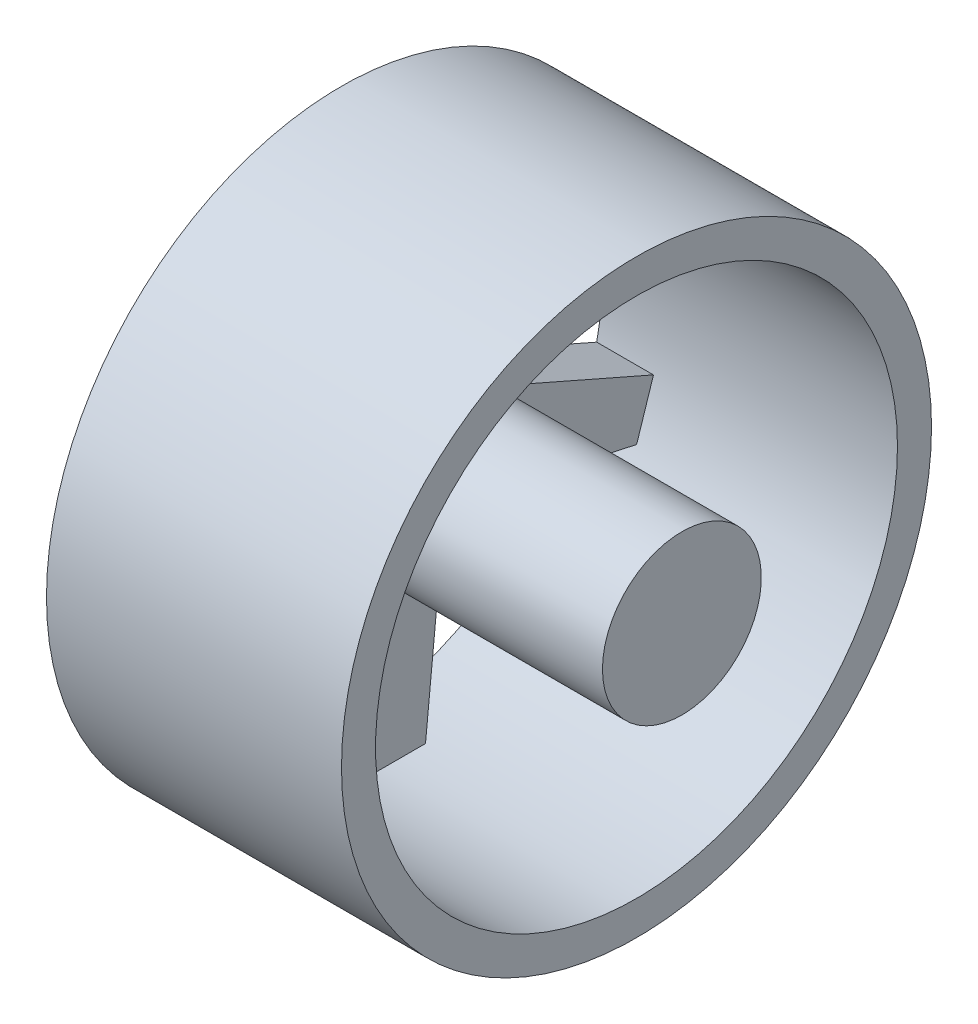
ISO-10303-21;
HEADER;
FILE_DESCRIPTION(('STEP AP214'),'2;1');
FILE_NAME('part.step','',(''),(''),'','','');
FILE_SCHEMA(('AUTOMOTIVE_DESIGN { 1 0 10303 214 1 1 1 1 }'));
ENDSEC;
DATA;
#1=APPLICATION_CONTEXT('core data for automotive mechanical design processes');
#2=APPLICATION_PROTOCOL_DEFINITION('international standard','automotive_design',2000,#1);
#3=PRODUCT_CONTEXT('',#1,'mechanical');
#4=PRODUCT('Part','Part','',(#3));
#5=PRODUCT_RELATED_PRODUCT_CATEGORY('part','',(#4));
#6=PRODUCT_DEFINITION_FORMATION('','',#4);
#7=PRODUCT_DEFINITION_CONTEXT('part definition',#1,'design');
#8=PRODUCT_DEFINITION('design','',#6,#7);
#9=PRODUCT_DEFINITION_SHAPE('','',#8);
#10=(LENGTH_UNIT() NAMED_UNIT(*) SI_UNIT(.MILLI.,.METRE.));
#11=(NAMED_UNIT(*) PLANE_ANGLE_UNIT() SI_UNIT($,.RADIAN.));
#12=(NAMED_UNIT(*) SI_UNIT($,.STERADIAN.) SOLID_ANGLE_UNIT());
#13=UNCERTAINTY_MEASURE_WITH_UNIT(LENGTH_MEASURE(1.E-05),#10,'distance_accuracy_value','');
#14=(GEOMETRIC_REPRESENTATION_CONTEXT(3) GLOBAL_UNCERTAINTY_ASSIGNED_CONTEXT((#13)) GLOBAL_UNIT_ASSIGNED_CONTEXT((#10,
#11,#12)) REPRESENTATION_CONTEXT('',''));
#15=CARTESIAN_POINT('',(0.,0.,0.));
#16=DIRECTION('',(0.,0.,1.));
#17=DIRECTION('',(1.,0.,0.));
#18=AXIS2_PLACEMENT_3D('',#15,#16,#17);
#19=CARTESIAN_POINT('',(30.,0.,0.));
#20=DIRECTION('',(-1.,0.,0.));
#21=DIRECTION('',(0.,0.,1.));
#22=AXIS2_PLACEMENT_3D('',#19,#20,#21);
#23=CYLINDRICAL_SURFACE('',#22,7.);
#24=CARTESIAN_POINT('',(30.,0.,0.));
#25=DIRECTION('',(-1.,0.,0.));
#26=DIRECTION('',(0.,0.,1.));
#27=AXIS2_PLACEMENT_3D('',#24,#25,#26);
#28=CIRCLE('',#27,7.);
#29=CARTESIAN_POINT('',(30.,0.,7.));
#30=VERTEX_POINT('',#29);
#31=EDGE_CURVE('E13',#30,#30,#28,.T.);
#32=ORIENTED_EDGE('',*,*,#31,.T.);
#33=EDGE_LOOP('',(#32));
#34=FACE_BOUND('',#33,.T.);
#35=CARTESIAN_POINT('',(5.,0.,0.));
#36=DIRECTION('',(-1.,0.,0.));
#37=DIRECTION('',(0.,0.,1.));
#38=AXIS2_PLACEMENT_3D('',#35,#36,#37);
#39=CIRCLE('',#38,7.);
#40=CARTESIAN_POINT('',(5.,-5.66311896062463,-4.11449676604731));
#41=VERTEX_POINT('',#40);
#42=CARTESIAN_POINT('',(5.,-5.66311896062463,4.11449676604731));
#43=VERTEX_POINT('',#42);
#44=EDGE_CURVE('E89',#41,#43,#39,.T.);
#45=ORIENTED_EDGE('',*,*,#44,.F.);
#46=CARTESIAN_POINT('',(5.,0.,0.));
#47=DIRECTION('',(-1.,0.,0.));
#48=DIRECTION('',(0.,0.,1.));
#49=AXIS2_PLACEMENT_3D('',#46,#47,#48);
#50=CIRCLE('',#49,7.);
#51=CARTESIAN_POINT('',(5.,2.16311896062463,-6.65739561406607));
#52=VERTEX_POINT('',#51);
#53=EDGE_CURVE('E213',#52,#41,#50,.T.);
#54=ORIENTED_EDGE('',*,*,#53,.F.);
#55=CARTESIAN_POINT('',(5.,0.,0.));
#56=DIRECTION('',(-1.,0.,0.));
#57=DIRECTION('',(0.,0.,1.));
#58=AXIS2_PLACEMENT_3D('',#55,#56,#57);
#59=CIRCLE('',#58,7.);
#60=CARTESIAN_POINT('',(5.,7.,0.));
#61=VERTEX_POINT('',#60);
#62=EDGE_CURVE('E293',#61,#52,#59,.T.);
#63=ORIENTED_EDGE('',*,*,#62,.F.);
#64=CARTESIAN_POINT('',(5.,0.,0.));
#65=DIRECTION('',(-1.,0.,0.));
#66=DIRECTION('',(0.,0.,1.));
#67=AXIS2_PLACEMENT_3D('',#64,#65,#66);
#68=CIRCLE('',#67,7.);
#69=CARTESIAN_POINT('',(5.,2.16311896062463,6.65739561406608));
#70=VERTEX_POINT('',#69);
#71=EDGE_CURVE('E271',#70,#61,#68,.T.);
#72=ORIENTED_EDGE('',*,*,#71,.F.);
#73=CARTESIAN_POINT('',(5.,0.,0.));
#74=DIRECTION('',(-1.,0.,0.));
#75=DIRECTION('',(0.,0.,1.));
#76=AXIS2_PLACEMENT_3D('',#73,#74,#75);
#77=CIRCLE('',#76,7.);
#78=EDGE_CURVE('E94',#43,#70,#77,.T.);
#79=ORIENTED_EDGE('',*,*,#78,.F.);
#80=EDGE_LOOP('',(#45,#54,#63,#72,#79));
#81=FACE_BOUND('',#80,.T.);
#82=ADVANCED_FACE('F75',(#34,#81),#23,.T.);
#83=CARTESIAN_POINT('',(30.,0.,0.));
#84=DIRECTION('',(-1.,0.,0.));
#85=DIRECTION('',(0.,0.,1.));
#86=AXIS2_PLACEMENT_3D('',#83,#84,#85);
#87=PLANE('',#86);
#88=ORIENTED_EDGE('',*,*,#31,.F.);
#89=EDGE_LOOP('',(#88));
#90=FACE_BOUND('',#89,.T.);
#91=ADVANCED_FACE('F390',(#90),#87,.F.);
#92=CARTESIAN_POINT('',(0.,0.,0.));
#93=DIRECTION('',(-1.,0.,0.));
#94=DIRECTION('',(0.,0.,1.));
#95=AXIS2_PLACEMENT_3D('',#92,#93,#94);
#96=PLANE('',#95);
#97=CARTESIAN_POINT('',(0.,0.,0.));
#98=DIRECTION('',(-1.,0.,0.));
#99=DIRECTION('',(0.,0.,1.));
#100=AXIS2_PLACEMENT_3D('',#97,#98,#99);
#101=CIRCLE('',#100,6.5);
#102=CARTESIAN_POINT('',(0.,0.,6.5));
#103=VERTEX_POINT('',#102);
#104=EDGE_CURVE('E458',#103,#103,#101,.T.);
#105=ORIENTED_EDGE('',*,*,#104,.F.);
#106=EDGE_LOOP('',(#105));
#107=FACE_BOUND('',#106,.T.);
#108=DIRECTION('',(0.,0.863176825578891,-0.504901740721448));
#109=VECTOR('',#108,1.);
#110=CARTESIAN_POINT('',(0.,-2.34998794471693,-4.01752454125229));
#111=LINE('',#110,#109);
#112=CARTESIAN_POINT('',(0.,2.16311896062463,-6.65739561406607));
#113=VERTEX_POINT('',#112);
#114=CARTESIAN_POINT('',(0.,17.0923309859801,-15.3900039462538));
#115=VERTEX_POINT('',#114);
#116=EDGE_CURVE('E297',#113,#115,#111,.T.);
#117=ORIENTED_EDGE('',*,*,#116,.F.);
#118=DIRECTION('',(0.,-0.401550923991079,-0.915836696929049));
#119=VECTOR('',#118,1.);
#120=CARTESIAN_POINT('',(0.,4.26262185992344,-1.86895737222182));
#121=LINE('',#120,#119);
#122=CARTESIAN_POINT('',(0.,-4.78196888880848,-22.4973948168776));
#123=VERTEX_POINT('',#122);
#124=EDGE_CURVE('E211',#113,#123,#121,.T.);
#125=ORIENTED_EDGE('',*,*,#124,.T.);
#126=DIRECTION('',(0.,-0.951056516295154,0.309016994374947));
#127=VECTOR('',#126,1.);
#128=CARTESIAN_POINT('',(0.,-7.06845583977594,-21.7544701713287));
#129=LINE('',#128,#127);
#130=CARTESIAN_POINT('',(0.,-9.3549427907434,-21.0115455257798));
#131=VERTEX_POINT('',#130);
#132=EDGE_CURVE('E186',#123,#131,#129,.T.);
#133=ORIENTED_EDGE('',*,*,#132,.T.);
#134=DIRECTION('',(0.,-0.213453782347401,-0.976953163054191));
#135=VECTOR('',#134,1.);
#136=CARTESIAN_POINT('',(0.,-4.54707910582749,0.993487989472711));
#137=LINE('',#136,#135);
#138=CARTESIAN_POINT('',(0.,-5.66311896062464,-4.11449676604731));
#139=VERTEX_POINT('',#138);
#140=EDGE_CURVE('E203',#139,#131,#137,.T.);
#141=ORIENTED_EDGE('',*,*,#140,.F.);
#142=DIRECTION('',(0.,-0.995098518096808,0.0988885194627609));
#143=VECTOR('',#142,1.);
#144=CARTESIAN_POINT('',(0.,-0.460261492218939,-4.63153388616124));
#145=LINE('',#144,#143);
#146=CARTESIAN_POINT('',(0.,-22.8740035934703,-2.40415465515602));
#147=VERTEX_POINT('',#146);
#148=EDGE_CURVE('E230',#139,#147,#145,.T.);
#149=ORIENTED_EDGE('',*,*,#148,.T.);
#150=DIRECTION('',(0.,0.,1.));
#151=VECTOR('',#150,1.);
#152=CARTESIAN_POINT('',(0.,-22.8740035934703,0.));
#153=LINE('',#152,#151);
#154=CARTESIAN_POINT('',(0.,-22.8740035934703,2.40415465515604));
#155=VERTEX_POINT('',#154);
#156=EDGE_CURVE('E226',#147,#155,#153,.T.);
#157=ORIENTED_EDGE('',*,*,#156,.T.);
#158=DIRECTION('',(0.,-0.995098518096808,-0.0988885194627599));
#159=VECTOR('',#158,1.);
#160=CARTESIAN_POINT('',(0.,-0.460261492218934,4.63153388616123));
#161=LINE('',#160,#159);
#162=CARTESIAN_POINT('',(0.,-5.66311896062463,4.11449676604732));
#163=VERTEX_POINT('',#162);
#164=EDGE_CURVE('E214',#163,#155,#161,.T.);
#165=ORIENTED_EDGE('',*,*,#164,.F.);
#166=DIRECTION('',(0.,-0.213453782347402,0.976953163054191));
#167=VECTOR('',#166,1.);
#168=CARTESIAN_POINT('',(0.,-4.54707910582748,-0.993487989472714));
#169=LINE('',#168,#167);
#170=CARTESIAN_POINT('',(0.,-9.35494279074341,21.0115455257798));
#171=VERTEX_POINT('',#170);
#172=EDGE_CURVE('E256',#163,#171,#169,.T.);
#173=ORIENTED_EDGE('',*,*,#172,.T.);
#174=DIRECTION('',(0.,0.951056516295154,0.309016994374948));
#175=VECTOR('',#174,1.);
#176=CARTESIAN_POINT('',(0.,-7.06845583977594,21.7544701713287));
#177=LINE('',#176,#175);
#178=CARTESIAN_POINT('',(0.,-4.78196888880846,22.4973948168776));
#179=VERTEX_POINT('',#178);
#180=EDGE_CURVE('E252',#171,#179,#177,.T.);
#181=ORIENTED_EDGE('',*,*,#180,.T.);
#182=DIRECTION('',(0.,-0.401550923991078,0.91583669692905));
#183=VECTOR('',#182,1.);
#184=CARTESIAN_POINT('',(0.,4.26262185992343,1.86895737222181));
#185=LINE('',#184,#183);
#186=CARTESIAN_POINT('',(0.,2.16311896062463,6.65739561406608));
#187=VERTEX_POINT('',#186);
#188=EDGE_CURVE('E243',#187,#179,#185,.T.);
#189=ORIENTED_EDGE('',*,*,#188,.F.);
#190=DIRECTION('',(0.,0.863176825578891,0.504901740721448));
#191=VECTOR('',#190,1.);
#192=CARTESIAN_POINT('',(0.,-2.34998794471693,4.01752454125229));
#193=LINE('',#192,#191);
#194=CARTESIAN_POINT('',(0.,17.0923309859801,15.3900039462538));
#195=VERTEX_POINT('',#194);
#196=EDGE_CURVE('E282',#187,#195,#193,.T.);
#197=ORIENTED_EDGE('',*,*,#196,.T.);
#198=DIRECTION('',(0.,0.587785252292474,-0.809016994374947));
#199=VECTOR('',#198,1.);
#200=CARTESIAN_POINT('',(0.,18.5054576365111,13.4450019731269));
#201=LINE('',#200,#199);
#202=CARTESIAN_POINT('',(0.,19.9185842870421,11.5));
#203=VERTEX_POINT('',#202);
#204=EDGE_CURVE('E278',#195,#203,#201,.T.);
#205=ORIENTED_EDGE('',*,*,#204,.T.);
#206=DIRECTION('',(0.,0.746926398856396,0.66490672630935));
#207=VECTOR('',#206,1.);
#208=CARTESIAN_POINT('',(0.,3.09470668283991,-3.47645470660346));
#209=LINE('',#208,#207);
#210=CARTESIAN_POINT('',(0.,7.,0.));
#211=VERTEX_POINT('',#210);
#212=EDGE_CURVE('E268',#211,#203,#209,.T.);
#213=ORIENTED_EDGE('',*,*,#212,.F.);
#214=DIRECTION('',(0.,0.746926398856396,-0.664906726309349));
#215=VECTOR('',#214,1.);
#216=CARTESIAN_POINT('',(0.,3.09470668283991,3.47645470660346));
#217=LINE('',#216,#215);
#218=CARTESIAN_POINT('',(0.,19.9185842870421,-11.5));
#219=VERTEX_POINT('',#218);
#220=EDGE_CURVE('E281',#211,#219,#217,.T.);
#221=ORIENTED_EDGE('',*,*,#220,.T.);
#222=DIRECTION('',(0.,-0.587785252292473,-0.809016994374947));
#223=VECTOR('',#222,1.);
#224=CARTESIAN_POINT('',(0.,18.5054576365111,-13.4450019731269));
#225=LINE('',#224,#223);
#226=EDGE_CURVE('E308',#219,#115,#225,.T.);
#227=ORIENTED_EDGE('',*,*,#226,.T.);
#228=EDGE_LOOP('',(#117,#125,#133,#141,#149,#157,#165,#173,#181,#189,#197,#205,#213,#221,#227));
#229=FACE_BOUND('',#228,.T.);
#230=ADVANCED_FACE('F340',(#107,#229),#96,.T.);
#231=CARTESIAN_POINT('',(5.,-2.34998794471693,-4.01752454125229));
#232=DIRECTION('',(0.,0.504901740721448,0.863176825578891));
#233=DIRECTION('',(0.,-0.863176825578891,0.504901740721448));
#234=AXIS2_PLACEMENT_3D('',#231,#232,#233);
#235=PLANE('',#234);
#236=ORIENTED_EDGE('',*,*,#116,.T.);
#237=DIRECTION('',(-1.,0.,0.));
#238=VECTOR('',#237,1.);
#239=CARTESIAN_POINT('',(5.,17.0923309859801,-15.3900039462538));
#240=LINE('',#239,#238);
#241=CARTESIAN_POINT('',(5.,17.0923309859801,-15.3900039462538));
#242=VERTEX_POINT('',#241);
#243=EDGE_CURVE('E314',#242,#115,#240,.T.);
#244=ORIENTED_EDGE('',*,*,#243,.F.);
#245=DIRECTION('',(0.,0.863176825578891,-0.504901740721448));
#246=VECTOR('',#245,1.);
#247=CARTESIAN_POINT('',(5.,-2.34998794471693,-4.01752454125229));
#248=LINE('',#247,#246);
#249=EDGE_CURVE('E303',#52,#242,#248,.T.);
#250=ORIENTED_EDGE('',*,*,#249,.F.);
#251=DIRECTION('',(-1.,0.,0.));
#252=VECTOR('',#251,1.);
#253=CARTESIAN_POINT('',(5.,2.16311896062463,-6.65739561406607));
#254=LINE('',#253,#252);
#255=EDGE_CURVE('E82',#52,#113,#254,.T.);
#256=ORIENTED_EDGE('',*,*,#255,.T.);
#257=EDGE_LOOP('',(#236,#244,#250,#256));
#258=FACE_BOUND('',#257,.T.);
#259=ADVANCED_FACE('F334',(#258),#235,.F.);
#260=CARTESIAN_POINT('',(5.,18.5054576365111,-13.4450019731269));
#261=DIRECTION('',(0.,0.809016994374947,-0.587785252292473));
#262=DIRECTION('',(0.,0.587785252292473,0.809016994374948));
#263=AXIS2_PLACEMENT_3D('',#260,#261,#262);
#264=PLANE('',#263);
#265=ORIENTED_EDGE('',*,*,#226,.F.);
#266=DIRECTION('',(-1.,0.,0.));
#267=VECTOR('',#266,1.);
#268=CARTESIAN_POINT('',(5.,19.9185842870421,-11.5));
#269=LINE('',#268,#267);
#270=CARTESIAN_POINT('',(5.,19.9185842870421,-11.5));
#271=VERTEX_POINT('',#270);
#272=EDGE_CURVE('E316',#271,#219,#269,.T.);
#273=ORIENTED_EDGE('',*,*,#272,.F.);
#274=DIRECTION('',(0.,-0.587785252292473,-0.809016994374947));
#275=VECTOR('',#274,1.);
#276=CARTESIAN_POINT('',(5.,18.5054576365111,-13.4450019731269));
#277=LINE('',#276,#275);
#278=EDGE_CURVE('E300',#271,#242,#277,.T.);
#279=ORIENTED_EDGE('',*,*,#278,.T.);
#280=ORIENTED_EDGE('',*,*,#243,.T.);
#281=EDGE_LOOP('',(#265,#273,#279,#280));
#282=FACE_BOUND('',#281,.T.);
#283=ADVANCED_FACE('F338',(#282),#264,.T.);
#284=CARTESIAN_POINT('',(5.,3.09470668283991,3.47645470660346));
#285=DIRECTION('',(0.,0.664906726309349,0.746926398856396));
#286=DIRECTION('',(0.,-0.746926398856396,0.664906726309349));
#287=AXIS2_PLACEMENT_3D('',#284,#285,#286);
#288=PLANE('',#287);
#289=ORIENTED_EDGE('',*,*,#220,.F.);
#290=DIRECTION('',(-1.,0.,0.));
#291=VECTOR('',#290,1.);
#292=CARTESIAN_POINT('',(5.,7.,0.));
#293=LINE('',#292,#291);
#294=EDGE_CURVE('E305',#61,#211,#293,.T.);
#295=ORIENTED_EDGE('',*,*,#294,.F.);
#296=DIRECTION('',(0.,0.746926398856396,-0.664906726309349));
#297=VECTOR('',#296,1.);
#298=CARTESIAN_POINT('',(5.,3.09470668283991,3.47645470660346));
#299=LINE('',#298,#297);
#300=EDGE_CURVE('E296',#61,#271,#299,.T.);
#301=ORIENTED_EDGE('',*,*,#300,.T.);
#302=ORIENTED_EDGE('',*,*,#272,.T.);
#303=EDGE_LOOP('',(#289,#295,#301,#302));
#304=FACE_BOUND('',#303,.T.);
#305=ADVANCED_FACE('F325',(#304),#288,.T.);
#306=CARTESIAN_POINT('',(5.,0.,0.));
#307=DIRECTION('',(-1.,0.,0.));
#308=DIRECTION('',(0.,0.,1.));
#309=AXIS2_PLACEMENT_3D('',#306,#307,#308);
#310=PLANE('',#309);
#311=ORIENTED_EDGE('',*,*,#62,.T.);
#312=ORIENTED_EDGE('',*,*,#249,.T.);
#313=ORIENTED_EDGE('',*,*,#278,.F.);
#314=ORIENTED_EDGE('',*,*,#300,.F.);
#315=EDGE_LOOP('',(#311,#312,#313,#314));
#316=FACE_BOUND('',#315,.T.);
#317=ADVANCED_FACE('F329',(#316),#310,.F.);
#318=CARTESIAN_POINT('',(5.,3.09470668283991,-3.47645470660346));
#319=DIRECTION('',(0.,-0.66490672630935,0.746926398856396));
#320=DIRECTION('',(0.,-0.746926398856396,-0.66490672630935));
#321=AXIS2_PLACEMENT_3D('',#318,#319,#320);
#322=PLANE('',#321);
#323=ORIENTED_EDGE('',*,*,#212,.T.);
#324=DIRECTION('',(-1.,0.,0.));
#325=VECTOR('',#324,1.);
#326=CARTESIAN_POINT('',(5.,19.9185842870421,11.5));
#327=LINE('',#326,#325);
#328=CARTESIAN_POINT('',(5.,19.9185842870421,11.5));
#329=VERTEX_POINT('',#328);
#330=EDGE_CURVE('E273',#329,#203,#327,.T.);
#331=ORIENTED_EDGE('',*,*,#330,.F.);
#332=DIRECTION('',(0.,0.746926398856396,0.66490672630935));
#333=VECTOR('',#332,1.);
#334=CARTESIAN_POINT('',(5.,3.09470668283991,-3.47645470660346));
#335=LINE('',#334,#333);
#336=EDGE_CURVE('E285',#61,#329,#335,.T.);
#337=ORIENTED_EDGE('',*,*,#336,.F.);
#338=ORIENTED_EDGE('',*,*,#294,.T.);
#339=EDGE_LOOP('',(#323,#331,#337,#338));
#340=FACE_BOUND('',#339,.T.);
#341=ADVANCED_FACE('F320',(#340),#322,.F.);
#342=CARTESIAN_POINT('',(5.,18.5054576365111,13.4450019731269));
#343=DIRECTION('',(0.,0.809016994374947,0.587785252292474));
#344=DIRECTION('',(0.,-0.587785252292474,0.809016994374947));
#345=AXIS2_PLACEMENT_3D('',#342,#343,#344);
#346=PLANE('',#345);
#347=ORIENTED_EDGE('',*,*,#204,.F.);
#348=DIRECTION('',(-1.,0.,0.));
#349=VECTOR('',#348,1.);
#350=CARTESIAN_POINT('',(5.,17.0923309859801,15.3900039462538));
#351=LINE('',#350,#349);
#352=CARTESIAN_POINT('',(5.,17.0923309859801,15.3900039462538));
#353=VERTEX_POINT('',#352);
#354=EDGE_CURVE('E269',#353,#195,#351,.T.);
#355=ORIENTED_EDGE('',*,*,#354,.F.);
#356=DIRECTION('',(0.,0.587785252292474,-0.809016994374947));
#357=VECTOR('',#356,1.);
#358=CARTESIAN_POINT('',(5.,18.5054576365111,13.4450019731269));
#359=LINE('',#358,#357);
#360=EDGE_CURVE('E275',#353,#329,#359,.T.);
#361=ORIENTED_EDGE('',*,*,#360,.T.);
#362=ORIENTED_EDGE('',*,*,#330,.T.);
#363=EDGE_LOOP('',(#347,#355,#361,#362));
#364=FACE_BOUND('',#363,.T.);
#365=ADVANCED_FACE('F344',(#364),#346,.T.);
#366=CARTESIAN_POINT('',(5.,-2.34998794471693,4.01752454125229));
#367=DIRECTION('',(0.,-0.504901740721448,0.863176825578891));
#368=DIRECTION('',(0.,-0.863176825578891,-0.504901740721448));
#369=AXIS2_PLACEMENT_3D('',#366,#367,#368);
#370=PLANE('',#369);
#371=ORIENTED_EDGE('',*,*,#196,.F.);
#372=DIRECTION('',(-1.,0.,0.));
#373=VECTOR('',#372,1.);
#374=CARTESIAN_POINT('',(5.,2.16311896062463,6.65739561406608));
#375=LINE('',#374,#373);
#376=EDGE_CURVE('E255',#70,#187,#375,.T.);
#377=ORIENTED_EDGE('',*,*,#376,.F.);
#378=DIRECTION('',(0.,0.863176825578891,0.504901740721448));
#379=VECTOR('',#378,1.);
#380=CARTESIAN_POINT('',(5.,-2.34998794471693,4.01752454125229));
#381=LINE('',#380,#379);
#382=EDGE_CURVE('E272',#70,#353,#381,.T.);
#383=ORIENTED_EDGE('',*,*,#382,.T.);
#384=ORIENTED_EDGE('',*,*,#354,.T.);
#385=EDGE_LOOP('',(#371,#377,#383,#384));
#386=FACE_BOUND('',#385,.T.);
#387=ADVANCED_FACE('F351',(#386),#370,.T.);
#388=CARTESIAN_POINT('',(5.,0.,0.));
#389=DIRECTION('',(-1.,0.,0.));
#390=DIRECTION('',(0.,0.,1.));
#391=AXIS2_PLACEMENT_3D('',#388,#389,#390);
#392=PLANE('',#391);
#393=ORIENTED_EDGE('',*,*,#71,.T.);
#394=ORIENTED_EDGE('',*,*,#336,.T.);
#395=ORIENTED_EDGE('',*,*,#360,.F.);
#396=ORIENTED_EDGE('',*,*,#382,.F.);
#397=EDGE_LOOP('',(#393,#394,#395,#396));
#398=FACE_BOUND('',#397,.T.);
#399=ADVANCED_FACE('F348',(#398),#392,.F.);
#400=CARTESIAN_POINT('',(5.,4.26262185992343,1.86895737222181));
#401=DIRECTION('',(0.,-0.91583669692905,-0.401550923991078));
#402=DIRECTION('',(0.,0.401550923991078,-0.91583669692905));
#403=AXIS2_PLACEMENT_3D('',#400,#401,#402);
#404=PLANE('',#403);
#405=ORIENTED_EDGE('',*,*,#188,.T.);
#406=DIRECTION('',(-1.,0.,0.));
#407=VECTOR('',#406,1.);
#408=CARTESIAN_POINT('',(5.,-4.78196888880846,22.4973948168776));
#409=LINE('',#408,#407);
#410=CARTESIAN_POINT('',(5.,-4.78196888880846,22.4973948168776));
#411=VERTEX_POINT('',#410);
#412=EDGE_CURVE('E247',#411,#179,#409,.T.);
#413=ORIENTED_EDGE('',*,*,#412,.F.);
#414=DIRECTION('',(0.,-0.401550923991078,0.91583669692905));
#415=VECTOR('',#414,1.);
#416=CARTESIAN_POINT('',(5.,4.26262185992343,1.86895737222181));
#417=LINE('',#416,#415);
#418=EDGE_CURVE('E259',#70,#411,#417,.T.);
#419=ORIENTED_EDGE('',*,*,#418,.F.);
#420=ORIENTED_EDGE('',*,*,#376,.T.);
#421=EDGE_LOOP('',(#405,#413,#419,#420));
#422=FACE_BOUND('',#421,.T.);
#423=ADVANCED_FACE('F353',(#422),#404,.F.);
#424=CARTESIAN_POINT('',(5.,-7.06845583977594,21.7544701713287));
#425=DIRECTION('',(0.,-0.309016994374948,0.951056516295154));
#426=DIRECTION('',(0.,-0.951056516295154,-0.309016994374948));
#427=AXIS2_PLACEMENT_3D('',#424,#425,#426);
#428=PLANE('',#427);
#429=ORIENTED_EDGE('',*,*,#180,.F.);
#430=DIRECTION('',(-1.,0.,0.));
#431=VECTOR('',#430,1.);
#432=CARTESIAN_POINT('',(5.,-9.35494279074341,21.0115455257798));
#433=LINE('',#432,#431);
#434=CARTESIAN_POINT('',(5.,-9.35494279074341,21.0115455257798));
#435=VERTEX_POINT('',#434);
#436=EDGE_CURVE('E244',#435,#171,#433,.T.);
#437=ORIENTED_EDGE('',*,*,#436,.F.);
#438=DIRECTION('',(0.,0.951056516295154,0.309016994374948));
#439=VECTOR('',#438,1.);
#440=CARTESIAN_POINT('',(5.,-7.06845583977594,21.7544701713287));
#441=LINE('',#440,#439);
#442=EDGE_CURVE('E249',#435,#411,#441,.T.);
#443=ORIENTED_EDGE('',*,*,#442,.T.);
#444=ORIENTED_EDGE('',*,*,#412,.T.);
#445=EDGE_LOOP('',(#429,#437,#443,#444));
#446=FACE_BOUND('',#445,.T.);
#447=ADVANCED_FACE('F380',(#446),#428,.T.);
#448=CARTESIAN_POINT('',(5.,-4.54707910582748,-0.993487989472714));
#449=DIRECTION('',(0.,-0.976953163054191,-0.213453782347402));
#450=DIRECTION('',(0.,0.213453782347402,-0.976953163054191));
#451=AXIS2_PLACEMENT_3D('',#448,#449,#450);
#452=PLANE('',#451);
#453=ORIENTED_EDGE('',*,*,#172,.F.);
#454=DIRECTION('',(-1.,0.,0.));
#455=VECTOR('',#454,1.);
#456=CARTESIAN_POINT('',(5.,-5.66311896062463,4.11449676604732));
#457=LINE('',#456,#455);
#458=EDGE_CURVE('E229',#43,#163,#457,.T.);
#459=ORIENTED_EDGE('',*,*,#458,.F.);
#460=DIRECTION('',(0.,-0.213453782347402,0.976953163054191));
#461=VECTOR('',#460,1.);
#462=CARTESIAN_POINT('',(5.,-4.54707910582748,-0.993487989472714));
#463=LINE('',#462,#461);
#464=EDGE_CURVE('E246',#43,#435,#463,.T.);
#465=ORIENTED_EDGE('',*,*,#464,.T.);
#466=ORIENTED_EDGE('',*,*,#436,.T.);
#467=EDGE_LOOP('',(#453,#459,#465,#466));
#468=FACE_BOUND('',#467,.T.);
#469=ADVANCED_FACE('F378',(#468),#452,.T.);
#470=CARTESIAN_POINT('',(5.,0.,0.));
#471=DIRECTION('',(-1.,0.,0.));
#472=DIRECTION('',(0.,0.,1.));
#473=AXIS2_PLACEMENT_3D('',#470,#471,#472);
#474=PLANE('',#473);
#475=ORIENTED_EDGE('',*,*,#78,.T.);
#476=ORIENTED_EDGE('',*,*,#418,.T.);
#477=ORIENTED_EDGE('',*,*,#442,.F.);
#478=ORIENTED_EDGE('',*,*,#464,.F.);
#479=EDGE_LOOP('',(#475,#476,#477,#478));
#480=FACE_BOUND('',#479,.T.);
#481=ADVANCED_FACE('F358',(#480),#474,.F.);
#482=CARTESIAN_POINT('',(5.,-0.460261492218934,4.63153388616123));
#483=DIRECTION('',(0.,0.0988885194627599,-0.995098518096808));
#484=DIRECTION('',(0.,0.995098518096808,0.0988885194627599));
#485=AXIS2_PLACEMENT_3D('',#482,#483,#484);
#486=PLANE('',#485);
#487=ORIENTED_EDGE('',*,*,#164,.T.);
#488=DIRECTION('',(-1.,0.,0.));
#489=VECTOR('',#488,1.);
#490=CARTESIAN_POINT('',(5.,-22.8740035934703,2.40415465515604));
#491=LINE('',#490,#489);
#492=CARTESIAN_POINT('',(5.,-22.8740035934703,2.40415465515604));
#493=VERTEX_POINT('',#492);
#494=EDGE_CURVE('E223',#493,#155,#491,.T.);
#495=ORIENTED_EDGE('',*,*,#494,.F.);
#496=DIRECTION('',(0.,-0.995098518096808,-0.0988885194627599));
#497=VECTOR('',#496,1.);
#498=CARTESIAN_POINT('',(5.,-0.460261492218934,4.63153388616123));
#499=LINE('',#498,#497);
#500=EDGE_CURVE('E219',#43,#493,#499,.T.);
#501=ORIENTED_EDGE('',*,*,#500,.F.);
#502=ORIENTED_EDGE('',*,*,#458,.T.);
#503=EDGE_LOOP('',(#487,#495,#501,#502));
#504=FACE_BOUND('',#503,.T.);
#505=ADVANCED_FACE('F367',(#504),#486,.F.);
#506=CARTESIAN_POINT('',(5.,-22.8740035934703,0.));
#507=DIRECTION('',(0.,-1.,0.));
#508=DIRECTION('',(0.,0.,-1.));
#509=AXIS2_PLACEMENT_3D('',#506,#507,#508);
#510=PLANE('',#509);
#511=ORIENTED_EDGE('',*,*,#156,.F.);
#512=DIRECTION('',(-1.,0.,0.));
#513=VECTOR('',#512,1.);
#514=CARTESIAN_POINT('',(5.,-22.8740035934703,-2.40415465515602));
#515=LINE('',#514,#513);
#516=CARTESIAN_POINT('',(5.,-22.8740035934703,-2.40415465515602));
#517=VERTEX_POINT('',#516);
#518=EDGE_CURVE('E220',#517,#147,#515,.T.);
#519=ORIENTED_EDGE('',*,*,#518,.F.);
#520=DIRECTION('',(0.,0.,1.));
#521=VECTOR('',#520,1.);
#522=CARTESIAN_POINT('',(5.,-22.8740035934703,0.));
#523=LINE('',#522,#521);
#524=EDGE_CURVE('E225',#517,#493,#523,.T.);
#525=ORIENTED_EDGE('',*,*,#524,.T.);
#526=ORIENTED_EDGE('',*,*,#494,.T.);
#527=EDGE_LOOP('',(#511,#519,#525,#526));
#528=FACE_BOUND('',#527,.T.);
#529=ADVANCED_FACE('F371',(#528),#510,.T.);
#530=CARTESIAN_POINT('',(5.,-0.460261492218939,-4.63153388616124));
#531=DIRECTION('',(0.,-0.0988885194627609,-0.995098518096808));
#532=DIRECTION('',(0.,0.995098518096808,-0.0988885194627609));
#533=AXIS2_PLACEMENT_3D('',#530,#531,#532);
#534=PLANE('',#533);
#535=ORIENTED_EDGE('',*,*,#148,.F.);
#536=DIRECTION('',(-1.,0.,0.));
#537=VECTOR('',#536,1.);
#538=CARTESIAN_POINT('',(5.,-5.66311896062464,-4.11449676604731));
#539=LINE('',#538,#537);
#540=EDGE_CURVE('E216',#41,#139,#539,.T.);
#541=ORIENTED_EDGE('',*,*,#540,.F.);
#542=DIRECTION('',(0.,-0.995098518096808,0.0988885194627609));
#543=VECTOR('',#542,1.);
#544=CARTESIAN_POINT('',(5.,-0.460261492218939,-4.63153388616124));
#545=LINE('',#544,#543);
#546=EDGE_CURVE('E222',#41,#517,#545,.T.);
#547=ORIENTED_EDGE('',*,*,#546,.T.);
#548=ORIENTED_EDGE('',*,*,#518,.T.);
#549=EDGE_LOOP('',(#535,#541,#547,#548));
#550=FACE_BOUND('',#549,.T.);
#551=ADVANCED_FACE('F373',(#550),#534,.T.);
#552=CARTESIAN_POINT('',(5.,0.,0.));
#553=DIRECTION('',(-1.,0.,0.));
#554=DIRECTION('',(0.,0.,1.));
#555=AXIS2_PLACEMENT_3D('',#552,#553,#554);
#556=PLANE('',#555);
#557=ORIENTED_EDGE('',*,*,#500,.T.);
#558=ORIENTED_EDGE('',*,*,#524,.F.);
#559=ORIENTED_EDGE('',*,*,#546,.F.);
#560=ORIENTED_EDGE('',*,*,#44,.T.);
#561=EDGE_LOOP('',(#557,#558,#559,#560));
#562=FACE_BOUND('',#561,.T.);
#563=ADVANCED_FACE('F363',(#562),#556,.F.);
#564=CARTESIAN_POINT('',(5.,-4.54707910582749,0.993487989472711));
#565=DIRECTION('',(0.,0.976953163054191,-0.213453782347401));
#566=DIRECTION('',(0.,0.213453782347401,0.976953163054191));
#567=AXIS2_PLACEMENT_3D('',#564,#565,#566);
#568=PLANE('',#567);
#569=ORIENTED_EDGE('',*,*,#140,.T.);
#570=DIRECTION('',(-1.,0.,0.));
#571=VECTOR('',#570,1.);
#572=CARTESIAN_POINT('',(5.,-9.3549427907434,-21.0115455257798));
#573=LINE('',#572,#571);
#574=CARTESIAN_POINT('',(5.,-9.3549427907434,-21.0115455257798));
#575=VERTEX_POINT('',#574);
#576=EDGE_CURVE('E198',#575,#131,#573,.T.);
#577=ORIENTED_EDGE('',*,*,#576,.F.);
#578=DIRECTION('',(0.,-0.213453782347401,-0.976953163054191));
#579=VECTOR('',#578,1.);
#580=CARTESIAN_POINT('',(5.,-4.54707910582749,0.993487989472711));
#581=LINE('',#580,#579);
#582=EDGE_CURVE('E190',#41,#575,#581,.T.);
#583=ORIENTED_EDGE('',*,*,#582,.F.);
#584=ORIENTED_EDGE('',*,*,#540,.T.);
#585=EDGE_LOOP('',(#569,#577,#583,#584));
#586=FACE_BOUND('',#585,.T.);
#587=ADVANCED_FACE('F376',(#586),#568,.F.);
#588=CARTESIAN_POINT('',(5.,-7.06845583977594,-21.7544701713287));
#589=DIRECTION('',(0.,-0.309016994374947,-0.951056516295154));
#590=DIRECTION('',(0.,0.951056516295154,-0.309016994374947));
#591=AXIS2_PLACEMENT_3D('',#588,#589,#590);
#592=PLANE('',#591);
#593=ORIENTED_EDGE('',*,*,#132,.F.);
#594=DIRECTION('',(-1.,0.,0.));
#595=VECTOR('',#594,1.);
#596=CARTESIAN_POINT('',(5.,-4.78196888880848,-22.4973948168776));
#597=LINE('',#596,#595);
#598=CARTESIAN_POINT('',(5.,-4.78196888880848,-22.4973948168776));
#599=VERTEX_POINT('',#598);
#600=EDGE_CURVE('E180',#599,#123,#597,.T.);
#601=ORIENTED_EDGE('',*,*,#600,.F.);
#602=DIRECTION('',(0.,-0.951056516295154,0.309016994374947));
#603=VECTOR('',#602,1.);
#604=CARTESIAN_POINT('',(5.,-7.06845583977594,-21.7544701713287));
#605=LINE('',#604,#603);
#606=EDGE_CURVE('E184',#599,#575,#605,.T.);
#607=ORIENTED_EDGE('',*,*,#606,.T.);
#608=ORIENTED_EDGE('',*,*,#576,.T.);
#609=EDGE_LOOP('',(#593,#601,#607,#608));
#610=FACE_BOUND('',#609,.T.);
#611=ADVANCED_FACE('F182',(#610),#592,.T.);
#612=CARTESIAN_POINT('',(5.,4.26262185992344,-1.86895737222182));
#613=DIRECTION('',(0.,0.915836696929049,-0.401550923991079));
#614=DIRECTION('',(0.,0.401550923991079,0.915836696929049));
#615=AXIS2_PLACEMENT_3D('',#612,#613,#614);
#616=PLANE('',#615);
#617=ORIENTED_EDGE('',*,*,#124,.F.);
#618=ORIENTED_EDGE('',*,*,#255,.F.);
#619=DIRECTION('',(0.,-0.401550923991079,-0.915836696929049));
#620=VECTOR('',#619,1.);
#621=CARTESIAN_POINT('',(5.,4.26262185992344,-1.86895737222182));
#622=LINE('',#621,#620);
#623=EDGE_CURVE('E191',#52,#599,#622,.T.);
#624=ORIENTED_EDGE('',*,*,#623,.T.);
#625=ORIENTED_EDGE('',*,*,#600,.T.);
#626=EDGE_LOOP('',(#617,#618,#624,#625));
#627=FACE_BOUND('',#626,.T.);
#628=ADVANCED_FACE('F195',(#627),#616,.T.);
#629=CARTESIAN_POINT('',(5.,0.,0.));
#630=DIRECTION('',(-1.,0.,0.));
#631=DIRECTION('',(0.,0.,1.));
#632=AXIS2_PLACEMENT_3D('',#629,#630,#631);
#633=PLANE('',#632);
#634=ORIENTED_EDGE('',*,*,#582,.T.);
#635=ORIENTED_EDGE('',*,*,#606,.F.);
#636=ORIENTED_EDGE('',*,*,#623,.F.);
#637=ORIENTED_EDGE('',*,*,#53,.T.);
#638=EDGE_LOOP('',(#634,#635,#636,#637));
#639=FACE_BOUND('',#638,.T.);
#640=ADVANCED_FACE('F200',(#639),#633,.F.);
#641=CARTESIAN_POINT('',(3.,0.,0.));
#642=DIRECTION('',(-1.,0.,0.));
#643=DIRECTION('',(0.,0.,1.));
#644=AXIS2_PLACEMENT_3D('',#641,#642,#643);
#645=CYLINDRICAL_SURFACE('',#644,6.5);
#646=CARTESIAN_POINT('',(3.,0.,0.));
#647=DIRECTION('',(-1.,0.,0.));
#648=DIRECTION('',(0.,0.,1.));
#649=AXIS2_PLACEMENT_3D('',#646,#647,#648);
#650=CIRCLE('',#649,6.5);
#651=CARTESIAN_POINT('',(3.,0.,6.5));
#652=VERTEX_POINT('',#651);
#653=EDGE_CURVE('E207',#652,#652,#650,.T.);
#654=ORIENTED_EDGE('',*,*,#653,.F.);
#655=EDGE_LOOP('',(#654));
#656=FACE_BOUND('',#655,.T.);
#657=ORIENTED_EDGE('',*,*,#104,.T.);
#658=EDGE_LOOP('',(#657));
#659=FACE_BOUND('',#658,.T.);
#660=ADVANCED_FACE('F447',(#656,#659),#645,.F.);
#661=CARTESIAN_POINT('',(3.,0.,0.));
#662=DIRECTION('',(-1.,0.,0.));
#663=DIRECTION('',(0.,0.,1.));
#664=AXIS2_PLACEMENT_3D('',#661,#662,#663);
#665=PLANE('',#664);
#666=ORIENTED_EDGE('',*,*,#653,.T.);
#667=EDGE_LOOP('',(#666));
#668=FACE_BOUND('',#667,.T.);
#669=ADVANCED_FACE('F450',(#668),#665,.T.);
#670=CLOSED_SHELL('',(#82,#91,#230,#259,#283,#305,#317,#341,#365,#387,#399,#423,#447,#469,#481,
#505,#529,#551,#563,#587,#611,#628,#640,#660,#669));
#671=MANIFOLD_SOLID_BREP('B2',#670);
#672=CARTESIAN_POINT('',(26.,0.,0.));
#673=DIRECTION('',(1.,0.,0.));
#674=DIRECTION('',(0.,0.,-1.));
#675=AXIS2_PLACEMENT_3D('',#672,#673,#674);
#676=PLANE('',#675);
#677=CARTESIAN_POINT('',(26.,0.,0.));
#678=DIRECTION('',(1.,0.,0.));
#679=DIRECTION('',(0.,0.,-1.));
#680=AXIS2_PLACEMENT_3D('',#677,#678,#679);
#681=CIRCLE('',#680,26.);
#682=CARTESIAN_POINT('',(26.,0.,-26.));
#683=VERTEX_POINT('',#682);
#684=EDGE_CURVE('E74',#683,#683,#681,.T.);
#685=ORIENTED_EDGE('',*,*,#684,.T.);
#686=EDGE_LOOP('',(#685));
#687=FACE_BOUND('',#686,.T.);
#688=CARTESIAN_POINT('',(26.,0.,0.));
#689=DIRECTION('',(1.,0.,0.));
#690=DIRECTION('',(0.,0.,-1.));
#691=AXIS2_PLACEMENT_3D('',#688,#689,#690);
#692=CIRCLE('',#691,23.);
#693=CARTESIAN_POINT('',(26.,0.,-23.));
#694=VERTEX_POINT('',#693);
#695=EDGE_CURVE('E626',#694,#694,#692,.T.);
#696=ORIENTED_EDGE('',*,*,#695,.F.);
#697=EDGE_LOOP('',(#696));
#698=FACE_BOUND('',#697,.T.);
#699=ADVANCED_FACE('F615',(#687,#698),#676,.T.);
#700=CARTESIAN_POINT('',(0.,0.,0.));
#701=DIRECTION('',(1.,0.,0.));
#702=DIRECTION('',(0.,0.,-1.));
#703=AXIS2_PLACEMENT_3D('',#700,#701,#702);
#704=PLANE('',#703);
#705=CARTESIAN_POINT('',(0.,0.,0.));
#706=DIRECTION('',(1.,0.,0.));
#707=DIRECTION('',(0.,0.,-1.));
#708=AXIS2_PLACEMENT_3D('',#705,#706,#707);
#709=CIRCLE('',#708,26.);
#710=CARTESIAN_POINT('',(0.,0.,-26.));
#711=VERTEX_POINT('',#710);
#712=EDGE_CURVE('E619',#711,#711,#709,.T.);
#713=ORIENTED_EDGE('',*,*,#712,.F.);
#714=EDGE_LOOP('',(#713));
#715=FACE_BOUND('',#714,.T.);
#716=CARTESIAN_POINT('',(0.,0.,0.));
#717=DIRECTION('',(1.,0.,0.));
#718=DIRECTION('',(0.,0.,-1.));
#719=AXIS2_PLACEMENT_3D('',#716,#717,#718);
#720=CIRCLE('',#719,23.);
#721=CARTESIAN_POINT('',(0.,0.,-23.));
#722=VERTEX_POINT('',#721);
#723=EDGE_CURVE('E628',#722,#722,#720,.T.);
#724=ORIENTED_EDGE('',*,*,#723,.T.);
#725=EDGE_LOOP('',(#724));
#726=FACE_BOUND('',#725,.T.);
#727=ADVANCED_FACE('F638',(#715,#726),#704,.F.);
#728=CARTESIAN_POINT('',(26.,0.,0.));
#729=DIRECTION('',(-1.,0.,0.));
#730=DIRECTION('',(0.,0.,1.));
#731=AXIS2_PLACEMENT_3D('',#728,#729,#730);
#732=CYLINDRICAL_SURFACE('',#731,26.);
#733=ORIENTED_EDGE('',*,*,#684,.F.);
#734=EDGE_LOOP('',(#733));
#735=FACE_BOUND('',#734,.T.);
#736=ORIENTED_EDGE('',*,*,#712,.T.);
#737=EDGE_LOOP('',(#736));
#738=FACE_BOUND('',#737,.T.);
#739=ADVANCED_FACE('F617',(#735,#738),#732,.T.);
#740=CARTESIAN_POINT('',(26.,0.,0.));
#741=DIRECTION('',(-1.,0.,0.));
#742=DIRECTION('',(0.,0.,1.));
#743=AXIS2_PLACEMENT_3D('',#740,#741,#742);
#744=CYLINDRICAL_SURFACE('',#743,23.);
#745=ORIENTED_EDGE('',*,*,#695,.T.);
#746=EDGE_LOOP('',(#745));
#747=FACE_BOUND('',#746,.T.);
#748=ORIENTED_EDGE('',*,*,#723,.F.);
#749=EDGE_LOOP('',(#748));
#750=FACE_BOUND('',#749,.T.);
#751=ADVANCED_FACE('F634',(#747,#750),#744,.F.);
#752=CLOSED_SHELL('',(#699,#727,#739,#751));
#753=MANIFOLD_SOLID_BREP('B7',#752);
#754=ADVANCED_BREP_SHAPE_REPRESENTATION('',(#18,#671,#753),#14);
#755=SHAPE_DEFINITION_REPRESENTATION(#9,#754);
ENDSEC;
END-ISO-10303-21;
